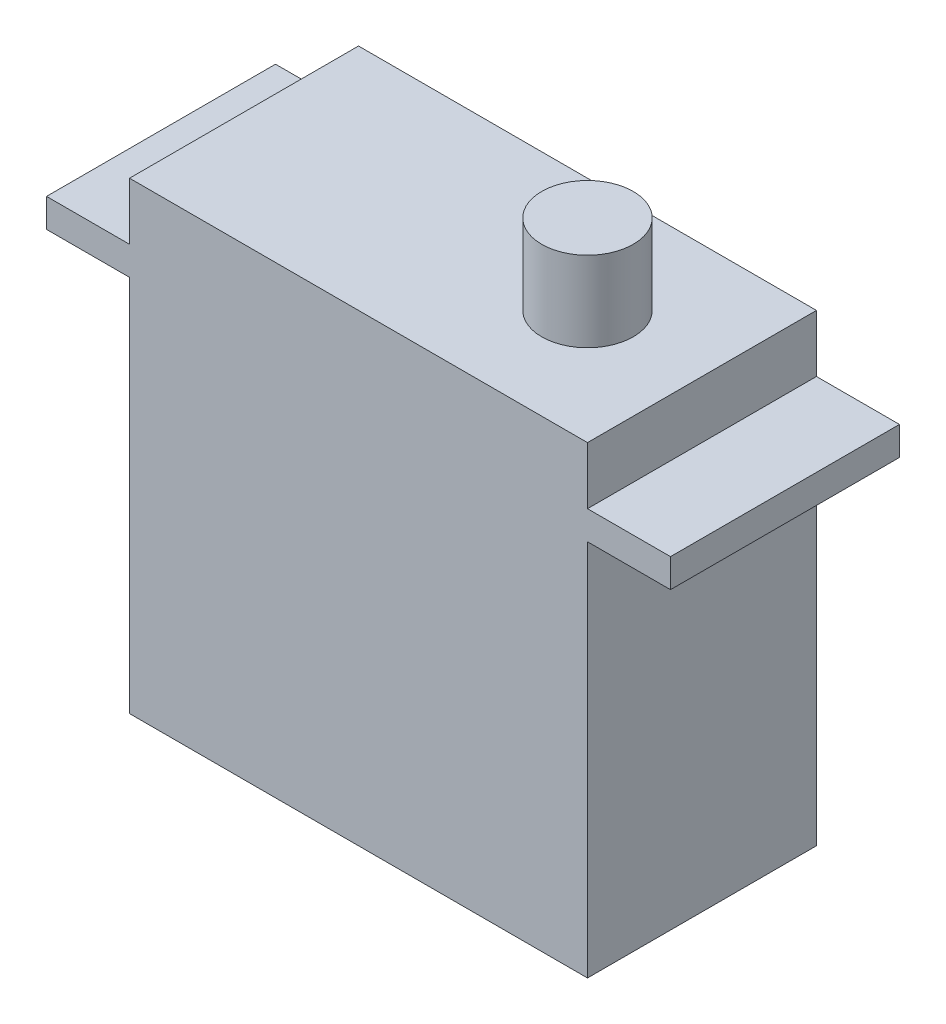
ISO-10303-21;
HEADER;
FILE_DESCRIPTION(('STEP AP214'),'2;1');
FILE_NAME('part.step','',(''),(''),'','','');
FILE_SCHEMA(('AUTOMOTIVE_DESIGN { 1 0 10303 214 1 1 1 1 }'));
ENDSEC;
DATA;
#1=APPLICATION_CONTEXT('core data for automotive mechanical design processes');
#2=APPLICATION_PROTOCOL_DEFINITION('international standard','automotive_design',2000,#1);
#3=PRODUCT_CONTEXT('',#1,'mechanical');
#4=PRODUCT('Part','Part','',(#3));
#5=PRODUCT_RELATED_PRODUCT_CATEGORY('part','',(#4));
#6=PRODUCT_DEFINITION_FORMATION('','',#4);
#7=PRODUCT_DEFINITION_CONTEXT('part definition',#1,'design');
#8=PRODUCT_DEFINITION('design','',#6,#7);
#9=PRODUCT_DEFINITION_SHAPE('','',#8);
#10=(LENGTH_UNIT() NAMED_UNIT(*) SI_UNIT(.MILLI.,.METRE.));
#11=(NAMED_UNIT(*) PLANE_ANGLE_UNIT() SI_UNIT($,.RADIAN.));
#12=(NAMED_UNIT(*) SI_UNIT($,.STERADIAN.) SOLID_ANGLE_UNIT());
#13=UNCERTAINTY_MEASURE_WITH_UNIT(LENGTH_MEASURE(1.E-05),#10,'distance_accuracy_value','');
#14=(GEOMETRIC_REPRESENTATION_CONTEXT(3) GLOBAL_UNCERTAINTY_ASSIGNED_CONTEXT((#13)) GLOBAL_UNIT_ASSIGNED_CONTEXT((#10,
#11,#12)) REPRESENTATION_CONTEXT('',''));
#15=CARTESIAN_POINT('',(0.,0.,0.));
#16=DIRECTION('',(0.,0.,1.));
#17=DIRECTION('',(1.,0.,0.));
#18=AXIS2_PLACEMENT_3D('',#15,#16,#17);
#19=CARTESIAN_POINT('',(0.,40.5,0.));
#20=DIRECTION('',(-1.,0.,0.));
#21=DIRECTION('',(0.,0.,1.));
#22=AXIS2_PLACEMENT_3D('',#19,#20,#21);
#23=PLANE('',#22);
#24=DIRECTION('',(0.,0.,1.));
#25=VECTOR('',#24,1.);
#26=CARTESIAN_POINT('',(0.,35.5,0.));
#27=LINE('',#26,#25);
#28=CARTESIAN_POINT('',(0.,35.5,-20.));
#29=VERTEX_POINT('',#28);
#30=CARTESIAN_POINT('',(0.,35.5,0.));
#31=VERTEX_POINT('',#30);
#32=EDGE_CURVE('E142',#29,#31,#27,.T.);
#33=ORIENTED_EDGE('',*,*,#32,.F.);
#34=DIRECTION('',(0.,-1.,0.));
#35=VECTOR('',#34,1.);
#36=CARTESIAN_POINT('',(0.,40.5,-20.));
#37=LINE('',#36,#35);
#38=CARTESIAN_POINT('',(0.,40.5,-20.));
#39=VERTEX_POINT('',#38);
#40=EDGE_CURVE('E11',#39,#29,#37,.T.);
#41=ORIENTED_EDGE('',*,*,#40,.F.);
#42=DIRECTION('',(0.,0.,-1.));
#43=VECTOR('',#42,1.);
#44=CARTESIAN_POINT('',(0.,40.5,0.));
#45=LINE('',#44,#43);
#46=CARTESIAN_POINT('',(0.,40.5,0.));
#47=VERTEX_POINT('',#46);
#48=EDGE_CURVE('E170',#47,#39,#45,.T.);
#49=ORIENTED_EDGE('',*,*,#48,.F.);
#50=DIRECTION('',(0.,-1.,0.));
#51=VECTOR('',#50,1.);
#52=CARTESIAN_POINT('',(0.,40.5,0.));
#53=LINE('',#52,#51);
#54=EDGE_CURVE('E154',#47,#31,#53,.T.);
#55=ORIENTED_EDGE('',*,*,#54,.T.);
#56=EDGE_LOOP('',(#33,#41,#49,#55));
#57=FACE_BOUND('',#56,.T.);
#58=ADVANCED_FACE('F45',(#57),#23,.F.);
#59=CARTESIAN_POINT('',(-40.,40.5,0.));
#60=DIRECTION('',(1.,0.,0.));
#61=DIRECTION('',(0.,0.,-1.));
#62=AXIS2_PLACEMENT_3D('',#59,#60,#61);
#63=PLANE('',#62);
#64=DIRECTION('',(0.,0.,-1.));
#65=VECTOR('',#64,1.);
#66=CARTESIAN_POINT('',(-40.,35.5,0.));
#67=LINE('',#66,#65);
#68=CARTESIAN_POINT('',(-40.,35.5,0.));
#69=VERTEX_POINT('',#68);
#70=CARTESIAN_POINT('',(-40.,35.5,-20.));
#71=VERTEX_POINT('',#70);
#72=EDGE_CURVE('E156',#69,#71,#67,.T.);
#73=ORIENTED_EDGE('',*,*,#72,.F.);
#74=DIRECTION('',(0.,-1.,0.));
#75=VECTOR('',#74,1.);
#76=CARTESIAN_POINT('',(-40.,40.5,0.));
#77=LINE('',#76,#75);
#78=CARTESIAN_POINT('',(-40.,40.5,0.));
#79=VERTEX_POINT('',#78);
#80=EDGE_CURVE('E201',#79,#69,#77,.T.);
#81=ORIENTED_EDGE('',*,*,#80,.F.);
#82=DIRECTION('',(0.,0.,1.));
#83=VECTOR('',#82,1.);
#84=CARTESIAN_POINT('',(-40.,40.5,0.));
#85=LINE('',#84,#83);
#86=CARTESIAN_POINT('',(-40.,40.5,-20.));
#87=VERTEX_POINT('',#86);
#88=EDGE_CURVE('E169',#87,#79,#85,.T.);
#89=ORIENTED_EDGE('',*,*,#88,.F.);
#90=DIRECTION('',(0.,-1.,0.));
#91=VECTOR('',#90,1.);
#92=CARTESIAN_POINT('',(-40.,40.5,-20.));
#93=LINE('',#92,#91);
#94=EDGE_CURVE('E165',#87,#71,#93,.T.);
#95=ORIENTED_EDGE('',*,*,#94,.T.);
#96=EDGE_LOOP('',(#73,#81,#89,#95));
#97=FACE_BOUND('',#96,.T.);
#98=ADVANCED_FACE('F274',(#97),#63,.F.);
#99=CARTESIAN_POINT('',(0.,33.,-20.));
#100=VERTEX_POINT('',#99);
#101=CARTESIAN_POINT('',(0.,0.,-20.));
#102=VERTEX_POINT('',#101);
#103=EDGE_CURVE('E54',#100,#102,#37,.T.);
#104=ORIENTED_EDGE('',*,*,#103,.F.);
#105=DIRECTION('',(0.,0.,1.));
#106=VECTOR('',#105,1.);
#107=CARTESIAN_POINT('',(0.,33.,0.));
#108=LINE('',#107,#106);
#109=CARTESIAN_POINT('',(0.,33.,0.));
#110=VERTEX_POINT('',#109);
#111=EDGE_CURVE('E148',#100,#110,#108,.T.);
#112=ORIENTED_EDGE('',*,*,#111,.T.);
#113=CARTESIAN_POINT('',(0.,0.,0.));
#114=VERTEX_POINT('',#113);
#115=EDGE_CURVE('E182',#110,#114,#53,.T.);
#116=ORIENTED_EDGE('',*,*,#115,.T.);
#117=DIRECTION('',(0.,0.,-1.));
#118=VECTOR('',#117,1.);
#119=CARTESIAN_POINT('',(0.,0.,0.));
#120=LINE('',#119,#118);
#121=EDGE_CURVE('E183',#114,#102,#120,.T.);
#122=ORIENTED_EDGE('',*,*,#121,.T.);
#123=EDGE_LOOP('',(#104,#112,#116,#122));
#124=FACE_BOUND('',#123,.T.);
#125=ADVANCED_FACE('F47',(#124),#23,.F.);
#126=CARTESIAN_POINT('',(0.,40.5,-20.));
#127=DIRECTION('',(0.,0.,1.));
#128=DIRECTION('',(1.,0.,0.));
#129=AXIS2_PLACEMENT_3D('',#126,#127,#128);
#130=PLANE('',#129);
#131=DIRECTION('',(-1.,0.,0.));
#132=VECTOR('',#131,1.);
#133=CARTESIAN_POINT('',(0.,0.,-20.));
#134=LINE('',#133,#132);
#135=CARTESIAN_POINT('',(-40.,0.,-20.));
#136=VERTEX_POINT('',#135);
#137=EDGE_CURVE('E187',#102,#136,#134,.T.);
#138=ORIENTED_EDGE('',*,*,#137,.T.);
#139=CARTESIAN_POINT('',(-40.,33.,-20.));
#140=VERTEX_POINT('',#139);
#141=EDGE_CURVE('E204',#140,#136,#93,.T.);
#142=ORIENTED_EDGE('',*,*,#141,.F.);
#143=DIRECTION('',(-1.,0.,0.));
#144=VECTOR('',#143,1.);
#145=CARTESIAN_POINT('',(-40.,33.,-20.));
#146=LINE('',#145,#144);
#147=CARTESIAN_POINT('',(-47.25,33.,-20.));
#148=VERTEX_POINT('',#147);
#149=EDGE_CURVE('E69',#140,#148,#146,.T.);
#150=ORIENTED_EDGE('',*,*,#149,.T.);
#151=DIRECTION('',(0.,1.,0.));
#152=VECTOR('',#151,1.);
#153=CARTESIAN_POINT('',(-47.25,33.,-20.));
#154=LINE('',#153,#152);
#155=CARTESIAN_POINT('',(-47.25,35.5,-20.));
#156=VERTEX_POINT('',#155);
#157=EDGE_CURVE('E251',#148,#156,#154,.T.);
#158=ORIENTED_EDGE('',*,*,#157,.T.);
#159=DIRECTION('',(-1.,0.,0.));
#160=VECTOR('',#159,1.);
#161=CARTESIAN_POINT('',(-40.,35.5,-20.));
#162=LINE('',#161,#160);
#163=EDGE_CURVE('E255',#71,#156,#162,.T.);
#164=ORIENTED_EDGE('',*,*,#163,.F.);
#165=ORIENTED_EDGE('',*,*,#94,.F.);
#166=DIRECTION('',(-1.,0.,0.));
#167=VECTOR('',#166,1.);
#168=CARTESIAN_POINT('',(0.,40.5,-20.));
#169=LINE('',#168,#167);
#170=EDGE_CURVE('E163',#39,#87,#169,.T.);
#171=ORIENTED_EDGE('',*,*,#170,.F.);
#172=ORIENTED_EDGE('',*,*,#40,.T.);
#173=DIRECTION('',(-1.,0.,0.));
#174=VECTOR('',#173,1.);
#175=CARTESIAN_POINT('',(0.,35.5,-20.));
#176=LINE('',#175,#174);
#177=CARTESIAN_POINT('',(7.25,35.5,-20.));
#178=VERTEX_POINT('',#177);
#179=EDGE_CURVE('E138',#178,#29,#176,.T.);
#180=ORIENTED_EDGE('',*,*,#179,.F.);
#181=DIRECTION('',(0.,1.,0.));
#182=VECTOR('',#181,1.);
#183=CARTESIAN_POINT('',(7.25,33.,-20.));
#184=LINE('',#183,#182);
#185=CARTESIAN_POINT('',(7.25,33.,-20.));
#186=VERTEX_POINT('',#185);
#187=EDGE_CURVE('E285',#186,#178,#184,.T.);
#188=ORIENTED_EDGE('',*,*,#187,.F.);
#189=DIRECTION('',(-1.,0.,0.));
#190=VECTOR('',#189,1.);
#191=CARTESIAN_POINT('',(0.,33.,-20.));
#192=LINE('',#191,#190);
#193=EDGE_CURVE('E296',#186,#100,#192,.T.);
#194=ORIENTED_EDGE('',*,*,#193,.T.);
#195=ORIENTED_EDGE('',*,*,#103,.T.);
#196=EDGE_LOOP('',(#138,#142,#150,#158,#164,#165,#171,#172,#180,#188,#194,#195));
#197=FACE_BOUND('',#196,.T.);
#198=ADVANCED_FACE('F161',(#197),#130,.F.);
#199=CARTESIAN_POINT('',(-40.,33.,0.));
#200=VERTEX_POINT('',#199);
#201=CARTESIAN_POINT('',(-40.,0.,0.));
#202=VERTEX_POINT('',#201);
#203=EDGE_CURVE('E200',#200,#202,#77,.T.);
#204=ORIENTED_EDGE('',*,*,#203,.F.);
#205=DIRECTION('',(0.,0.,-1.));
#206=VECTOR('',#205,1.);
#207=CARTESIAN_POINT('',(-40.,33.,0.));
#208=LINE('',#207,#206);
#209=EDGE_CURVE('E216',#200,#140,#208,.T.);
#210=ORIENTED_EDGE('',*,*,#209,.T.);
#211=ORIENTED_EDGE('',*,*,#141,.T.);
#212=DIRECTION('',(0.,0.,1.));
#213=VECTOR('',#212,1.);
#214=CARTESIAN_POINT('',(-40.,0.,0.));
#215=LINE('',#214,#213);
#216=EDGE_CURVE('E191',#136,#202,#215,.T.);
#217=ORIENTED_EDGE('',*,*,#216,.T.);
#218=EDGE_LOOP('',(#204,#210,#211,#217));
#219=FACE_BOUND('',#218,.T.);
#220=ADVANCED_FACE('F213',(#219),#63,.F.);
#221=CARTESIAN_POINT('',(0.,40.5,0.));
#222=DIRECTION('',(0.,0.,-1.));
#223=DIRECTION('',(-1.,0.,0.));
#224=AXIS2_PLACEMENT_3D('',#221,#222,#223);
#225=PLANE('',#224);
#226=DIRECTION('',(1.,0.,0.));
#227=VECTOR('',#226,1.);
#228=CARTESIAN_POINT('',(0.,0.,0.));
#229=LINE('',#228,#227);
#230=EDGE_CURVE('E176',#202,#114,#229,.T.);
#231=ORIENTED_EDGE('',*,*,#230,.T.);
#232=ORIENTED_EDGE('',*,*,#115,.F.);
#233=DIRECTION('',(1.,0.,0.));
#234=VECTOR('',#233,1.);
#235=CARTESIAN_POINT('',(0.,33.,0.));
#236=LINE('',#235,#234);
#237=CARTESIAN_POINT('',(7.25,33.,0.));
#238=VERTEX_POINT('',#237);
#239=EDGE_CURVE('E61',#110,#238,#236,.T.);
#240=ORIENTED_EDGE('',*,*,#239,.T.);
#241=DIRECTION('',(0.,1.,0.));
#242=VECTOR('',#241,1.);
#243=CARTESIAN_POINT('',(7.25,33.,0.));
#244=LINE('',#243,#242);
#245=CARTESIAN_POINT('',(7.25,35.5,0.));
#246=VERTEX_POINT('',#245);
#247=EDGE_CURVE('E290',#238,#246,#244,.T.);
#248=ORIENTED_EDGE('',*,*,#247,.T.);
#249=DIRECTION('',(1.,0.,0.));
#250=VECTOR('',#249,1.);
#251=CARTESIAN_POINT('',(0.,35.5,0.));
#252=LINE('',#251,#250);
#253=EDGE_CURVE('E157',#31,#246,#252,.T.);
#254=ORIENTED_EDGE('',*,*,#253,.F.);
#255=ORIENTED_EDGE('',*,*,#54,.F.);
#256=DIRECTION('',(1.,0.,0.));
#257=VECTOR('',#256,1.);
#258=CARTESIAN_POINT('',(0.,40.5,0.));
#259=LINE('',#258,#257);
#260=EDGE_CURVE('E174',#79,#47,#259,.T.);
#261=ORIENTED_EDGE('',*,*,#260,.F.);
#262=ORIENTED_EDGE('',*,*,#80,.T.);
#263=DIRECTION('',(1.,0.,0.));
#264=VECTOR('',#263,1.);
#265=CARTESIAN_POINT('',(-40.,35.5,0.));
#266=LINE('',#265,#264);
#267=CARTESIAN_POINT('',(-47.25,35.5,0.));
#268=VERTEX_POINT('',#267);
#269=EDGE_CURVE('E242',#268,#69,#266,.T.);
#270=ORIENTED_EDGE('',*,*,#269,.F.);
#271=DIRECTION('',(0.,1.,0.));
#272=VECTOR('',#271,1.);
#273=CARTESIAN_POINT('',(-47.25,33.,0.));
#274=LINE('',#273,#272);
#275=CARTESIAN_POINT('',(-47.25,33.,0.));
#276=VERTEX_POINT('',#275);
#277=EDGE_CURVE('E188',#276,#268,#274,.T.);
#278=ORIENTED_EDGE('',*,*,#277,.F.);
#279=DIRECTION('',(1.,0.,0.));
#280=VECTOR('',#279,1.);
#281=CARTESIAN_POINT('',(-40.,33.,0.));
#282=LINE('',#281,#280);
#283=EDGE_CURVE('E228',#276,#200,#282,.T.);
#284=ORIENTED_EDGE('',*,*,#283,.T.);
#285=ORIENTED_EDGE('',*,*,#203,.T.);
#286=EDGE_LOOP('',(#231,#232,#240,#248,#254,#255,#261,#262,#270,#278,#284,#285));
#287=FACE_BOUND('',#286,.T.);
#288=ADVANCED_FACE('F225',(#287),#225,.F.);
#289=CARTESIAN_POINT('',(0.,40.5,0.));
#290=DIRECTION('',(0.,1.,0.));
#291=DIRECTION('',(0.,0.,1.));
#292=AXIS2_PLACEMENT_3D('',#289,#290,#291);
#293=PLANE('',#292);
#294=ORIENTED_EDGE('',*,*,#260,.T.);
#295=ORIENTED_EDGE('',*,*,#48,.T.);
#296=ORIENTED_EDGE('',*,*,#170,.T.);
#297=ORIENTED_EDGE('',*,*,#88,.T.);
#298=EDGE_LOOP('',(#294,#295,#296,#297));
#299=FACE_BOUND('',#298,.T.);
#300=CARTESIAN_POINT('',(-10.,40.5,-10.));
#301=DIRECTION('',(0.,1.,0.));
#302=DIRECTION('',(0.,0.,1.));
#303=AXIS2_PLACEMENT_3D('',#300,#301,#302);
#304=CIRCLE('',#303,4.);
#305=CARTESIAN_POINT('',(-10.,40.5,-6.));
#306=VERTEX_POINT('',#305);
#307=EDGE_CURVE('E282',#306,#306,#304,.F.);
#308=ORIENTED_EDGE('',*,*,#307,.T.);
#309=EDGE_LOOP('',(#308));
#310=FACE_BOUND('',#309,.T.);
#311=ADVANCED_FACE('F276',(#299,#310),#293,.T.);
#312=CARTESIAN_POINT('',(0.,0.,0.));
#313=DIRECTION('',(0.,1.,0.));
#314=DIRECTION('',(0.,0.,1.));
#315=AXIS2_PLACEMENT_3D('',#312,#313,#314);
#316=PLANE('',#315);
#317=ORIENTED_EDGE('',*,*,#121,.F.);
#318=ORIENTED_EDGE('',*,*,#230,.F.);
#319=ORIENTED_EDGE('',*,*,#216,.F.);
#320=ORIENTED_EDGE('',*,*,#137,.F.);
#321=EDGE_LOOP('',(#317,#318,#319,#320));
#322=FACE_BOUND('',#321,.T.);
#323=ADVANCED_FACE('F222',(#322),#316,.F.);
#324=CARTESIAN_POINT('',(-47.25,33.,0.));
#325=DIRECTION('',(-1.,0.,0.));
#326=DIRECTION('',(0.,0.,1.));
#327=AXIS2_PLACEMENT_3D('',#324,#325,#326);
#328=PLANE('',#327);
#329=DIRECTION('',(0.,0.,1.));
#330=VECTOR('',#329,1.);
#331=CARTESIAN_POINT('',(-47.25,35.5,0.));
#332=LINE('',#331,#330);
#333=EDGE_CURVE('E259',#156,#268,#332,.T.);
#334=ORIENTED_EDGE('',*,*,#333,.F.);
#335=ORIENTED_EDGE('',*,*,#157,.F.);
#336=DIRECTION('',(0.,0.,1.));
#337=VECTOR('',#336,1.);
#338=CARTESIAN_POINT('',(-47.25,33.,0.));
#339=LINE('',#338,#337);
#340=EDGE_CURVE('E245',#148,#276,#339,.T.);
#341=ORIENTED_EDGE('',*,*,#340,.T.);
#342=ORIENTED_EDGE('',*,*,#277,.T.);
#343=EDGE_LOOP('',(#334,#335,#341,#342));
#344=FACE_BOUND('',#343,.T.);
#345=ADVANCED_FACE('F269',(#344),#328,.T.);
#346=CARTESIAN_POINT('',(0.,33.,0.));
#347=DIRECTION('',(0.,1.,0.));
#348=DIRECTION('',(0.,0.,1.));
#349=AXIS2_PLACEMENT_3D('',#346,#347,#348);
#350=PLANE('',#349);
#351=ORIENTED_EDGE('',*,*,#209,.F.);
#352=ORIENTED_EDGE('',*,*,#283,.F.);
#353=ORIENTED_EDGE('',*,*,#340,.F.);
#354=ORIENTED_EDGE('',*,*,#149,.F.);
#355=EDGE_LOOP('',(#351,#352,#353,#354));
#356=FACE_BOUND('',#355,.T.);
#357=ADVANCED_FACE('F337',(#356),#350,.F.);
#358=CARTESIAN_POINT('',(0.,35.5,0.));
#359=DIRECTION('',(0.,1.,0.));
#360=DIRECTION('',(0.,0.,1.));
#361=AXIS2_PLACEMENT_3D('',#358,#359,#360);
#362=PLANE('',#361);
#363=ORIENTED_EDGE('',*,*,#72,.T.);
#364=ORIENTED_EDGE('',*,*,#163,.T.);
#365=ORIENTED_EDGE('',*,*,#333,.T.);
#366=ORIENTED_EDGE('',*,*,#269,.T.);
#367=EDGE_LOOP('',(#363,#364,#365,#366));
#368=FACE_BOUND('',#367,.T.);
#369=ADVANCED_FACE('F272',(#368),#362,.T.);
#370=CARTESIAN_POINT('',(7.25,33.,0.));
#371=DIRECTION('',(1.,0.,0.));
#372=DIRECTION('',(0.,0.,-1.));
#373=AXIS2_PLACEMENT_3D('',#370,#371,#372);
#374=PLANE('',#373);
#375=DIRECTION('',(0.,0.,-1.));
#376=VECTOR('',#375,1.);
#377=CARTESIAN_POINT('',(7.25,35.5,0.));
#378=LINE('',#377,#376);
#379=EDGE_CURVE('E145',#246,#178,#378,.T.);
#380=ORIENTED_EDGE('',*,*,#379,.F.);
#381=ORIENTED_EDGE('',*,*,#247,.F.);
#382=DIRECTION('',(0.,0.,-1.));
#383=VECTOR('',#382,1.);
#384=CARTESIAN_POINT('',(7.25,33.,0.));
#385=LINE('',#384,#383);
#386=EDGE_CURVE('E236',#238,#186,#385,.T.);
#387=ORIENTED_EDGE('',*,*,#386,.T.);
#388=ORIENTED_EDGE('',*,*,#187,.T.);
#389=EDGE_LOOP('',(#380,#381,#387,#388));
#390=FACE_BOUND('',#389,.T.);
#391=ADVANCED_FACE('F306',(#390),#374,.T.);
#392=CARTESIAN_POINT('',(0.,33.,0.));
#393=DIRECTION('',(0.,-1.,0.));
#394=DIRECTION('',(0.,0.,-1.));
#395=AXIS2_PLACEMENT_3D('',#392,#393,#394);
#396=PLANE('',#395);
#397=ORIENTED_EDGE('',*,*,#111,.F.);
#398=ORIENTED_EDGE('',*,*,#193,.F.);
#399=ORIENTED_EDGE('',*,*,#386,.F.);
#400=ORIENTED_EDGE('',*,*,#239,.F.);
#401=EDGE_LOOP('',(#397,#398,#399,#400));
#402=FACE_BOUND('',#401,.T.);
#403=ADVANCED_FACE('F307',(#402),#396,.T.);
#404=CARTESIAN_POINT('',(0.,35.5,0.));
#405=DIRECTION('',(0.,-1.,0.));
#406=DIRECTION('',(0.,0.,-1.));
#407=AXIS2_PLACEMENT_3D('',#404,#405,#406);
#408=PLANE('',#407);
#409=ORIENTED_EDGE('',*,*,#32,.T.);
#410=ORIENTED_EDGE('',*,*,#253,.T.);
#411=ORIENTED_EDGE('',*,*,#379,.T.);
#412=ORIENTED_EDGE('',*,*,#179,.T.);
#413=EDGE_LOOP('',(#409,#410,#411,#412));
#414=FACE_BOUND('',#413,.T.);
#415=ADVANCED_FACE('F140',(#414),#408,.F.);
#416=CARTESIAN_POINT('',(-10.,12.2157287525381,-10.));
#417=DIRECTION('',(0.,1.,0.));
#418=DIRECTION('',(0.,0.,1.));
#419=AXIS2_PLACEMENT_3D('',#416,#417,#418);
#420=CYLINDRICAL_SURFACE('',#419,4.);
#421=ORIENTED_EDGE('',*,*,#307,.F.);
#422=EDGE_LOOP('',(#421));
#423=FACE_BOUND('',#422,.T.);
#424=CARTESIAN_POINT('',(-10.,47.5,-10.));
#425=DIRECTION('',(0.,1.,0.));
#426=DIRECTION('',(0.,0.,1.));
#427=AXIS2_PLACEMENT_3D('',#424,#425,#426);
#428=CIRCLE('',#427,4.);
#429=CARTESIAN_POINT('',(-10.,47.5,-6.));
#430=VERTEX_POINT('',#429);
#431=EDGE_CURVE('E286',#430,#430,#428,.T.);
#432=ORIENTED_EDGE('',*,*,#431,.F.);
#433=EDGE_LOOP('',(#432));
#434=FACE_BOUND('',#433,.T.);
#435=ADVANCED_FACE('F314',(#423,#434),#420,.T.);
#436=CARTESIAN_POINT('',(-10.,47.5,-10.));
#437=DIRECTION('',(0.,1.,0.));
#438=DIRECTION('',(0.,0.,1.));
#439=AXIS2_PLACEMENT_3D('',#436,#437,#438);
#440=PLANE('',#439);
#441=ORIENTED_EDGE('',*,*,#431,.T.);
#442=EDGE_LOOP('',(#441));
#443=FACE_BOUND('',#442,.T.);
#444=ADVANCED_FACE('F370',(#443),#440,.T.);
#445=CLOSED_SHELL('',(#58,#98,#125,#198,#220,#288,#311,#323,#345,#357,#369,#391,#403,#415,#435,#444));
#446=MANIFOLD_SOLID_BREP('B2',#445);
#447=ADVANCED_BREP_SHAPE_REPRESENTATION('',(#18,#446),#14);
#448=SHAPE_DEFINITION_REPRESENTATION(#9,#447);
ENDSEC;
END-ISO-10303-21;
